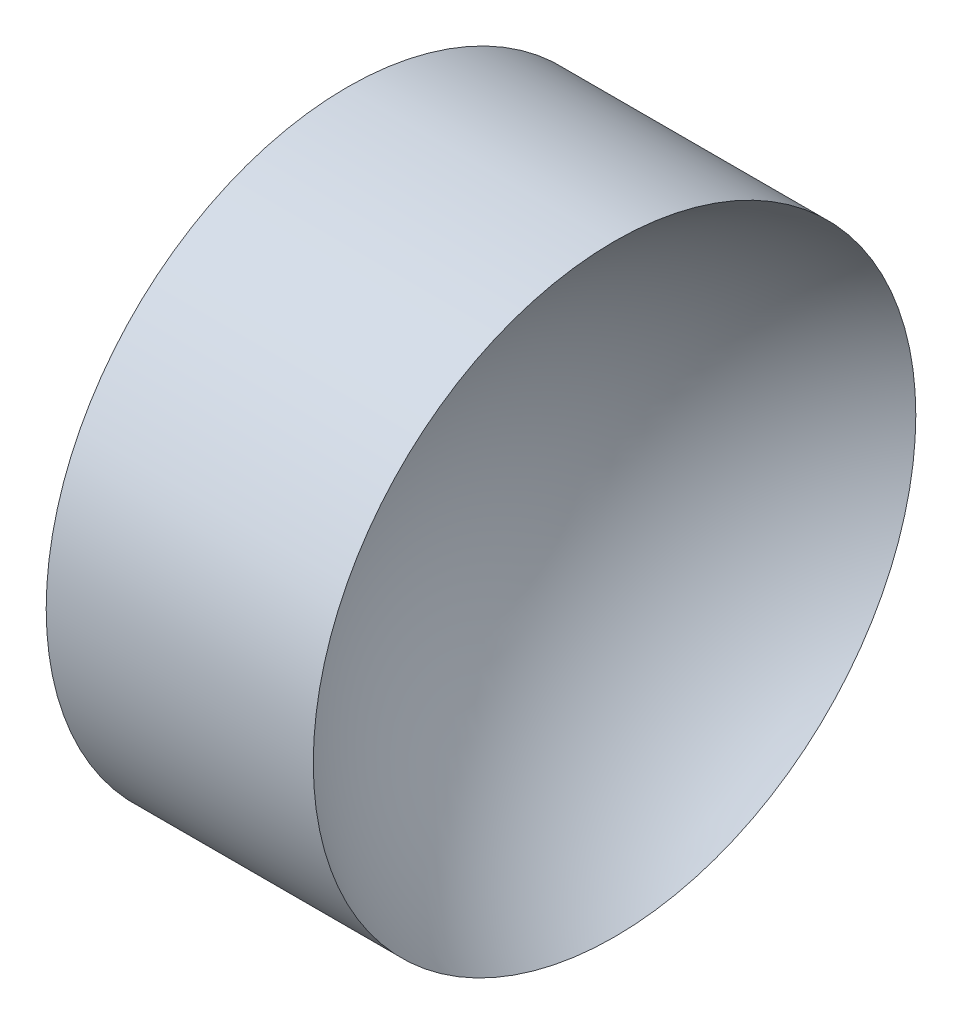
ISO-10303-21;
HEADER;
FILE_DESCRIPTION(('STEP AP214'),'2;1');
FILE_NAME('part.step','',(''),(''),'','','');
FILE_SCHEMA(('AUTOMOTIVE_DESIGN { 1 0 10303 214 1 1 1 1 }'));
ENDSEC;
DATA;
#1=APPLICATION_CONTEXT('core data for automotive mechanical design processes');
#2=APPLICATION_PROTOCOL_DEFINITION('international standard','automotive_design',2000,#1);
#3=PRODUCT_CONTEXT('',#1,'mechanical');
#4=PRODUCT('Part','Part','',(#3));
#5=PRODUCT_RELATED_PRODUCT_CATEGORY('part','',(#4));
#6=PRODUCT_DEFINITION_FORMATION('','',#4);
#7=PRODUCT_DEFINITION_CONTEXT('part definition',#1,'design');
#8=PRODUCT_DEFINITION('design','',#6,#7);
#9=PRODUCT_DEFINITION_SHAPE('','',#8);
#10=(LENGTH_UNIT() NAMED_UNIT(*) SI_UNIT(.MILLI.,.METRE.));
#11=(NAMED_UNIT(*) PLANE_ANGLE_UNIT() SI_UNIT($,.RADIAN.));
#12=(NAMED_UNIT(*) SI_UNIT($,.STERADIAN.) SOLID_ANGLE_UNIT());
#13=UNCERTAINTY_MEASURE_WITH_UNIT(LENGTH_MEASURE(1.E-05),#10,'distance_accuracy_value','');
#14=(GEOMETRIC_REPRESENTATION_CONTEXT(3) GLOBAL_UNCERTAINTY_ASSIGNED_CONTEXT((#13)) GLOBAL_UNIT_ASSIGNED_CONTEXT((#10,
#11,#12)) REPRESENTATION_CONTEXT('',''));
#15=CARTESIAN_POINT('',(0.,0.,0.));
#16=DIRECTION('',(0.,0.,1.));
#17=DIRECTION('',(1.,0.,0.));
#18=AXIS2_PLACEMENT_3D('',#15,#16,#17);
#19=CARTESIAN_POINT('',(48.5970389295931,26.0622521828061,0.));
#20=DIRECTION('',(-1.,0.,0.));
#21=DIRECTION('',(0.,-1.,0.));
#22=AXIS2_PLACEMENT_3D('',#19,#20,#21);
#23=SPHERICAL_SURFACE('',#22,5.73);
#24=CARTESIAN_POINT('',(45.7983070739128,26.0622521828061,0.));
#25=DIRECTION('',(-1.,0.,0.));
#26=DIRECTION('',(0.,0.,1.));
#27=AXIS2_PLACEMENT_3D('',#24,#25,#26);
#28=CIRCLE('',#27,5.);
#29=CARTESIAN_POINT('',(45.7983070739128,26.0622521828061,5.));
#30=VERTEX_POINT('',#29);
#31=EDGE_CURVE('E10',#30,#30,#28,.T.);
#32=ORIENTED_EDGE('',*,*,#31,.F.);
#33=EDGE_LOOP('',(#32));
#34=FACE_BOUND('',#33,.T.);
#35=ADVANCED_FACE('F35',(#34),#23,.F.);
#36=CARTESIAN_POINT('',(39.7365000133641,26.0622521828061,0.));
#37=DIRECTION('',(-1.,0.,0.));
#38=DIRECTION('',(0.,0.,1.));
#39=AXIS2_PLACEMENT_3D('',#36,#37,#38);
#40=CYLINDRICAL_SURFACE('',#39,5.);
#41=CARTESIAN_POINT('',(41.3658273254976,26.0622521828061,0.));
#42=DIRECTION('',(-1.,0.,0.));
#43=DIRECTION('',(0.,0.,1.));
#44=AXIS2_PLACEMENT_3D('',#41,#42,#43);
#45=CIRCLE('',#44,5.);
#46=CARTESIAN_POINT('',(41.3658273254976,26.0622521828061,5.));
#47=VERTEX_POINT('',#46);
#48=EDGE_CURVE('E41',#47,#47,#45,.T.);
#49=ORIENTED_EDGE('',*,*,#48,.F.);
#50=EDGE_LOOP('',(#49));
#51=FACE_BOUND('',#50,.T.);
#52=ORIENTED_EDGE('',*,*,#31,.T.);
#53=EDGE_LOOP('',(#52));
#54=FACE_BOUND('',#53,.T.);
#55=ADVANCED_FACE('F49',(#51,#54),#40,.T.);
#56=CARTESIAN_POINT('',(41.3658273254976,26.0622521828061,0.));
#57=DIRECTION('',(1.,0.,0.));
#58=DIRECTION('',(0.,0.,-1.));
#59=AXIS2_PLACEMENT_3D('',#56,#57,#58);
#60=PLANE('',#59);
#61=ORIENTED_EDGE('',*,*,#48,.T.);
#62=EDGE_LOOP('',(#61));
#63=FACE_BOUND('',#62,.T.);
#64=ADVANCED_FACE('F47',(#63),#60,.F.);
#65=CLOSED_SHELL('',(#35,#55,#64));
#66=MANIFOLD_SOLID_BREP('B2',#65);
#67=ADVANCED_BREP_SHAPE_REPRESENTATION('',(#18,#66),#14);
#68=SHAPE_DEFINITION_REPRESENTATION(#9,#67);
ENDSEC;
END-ISO-10303-21;
